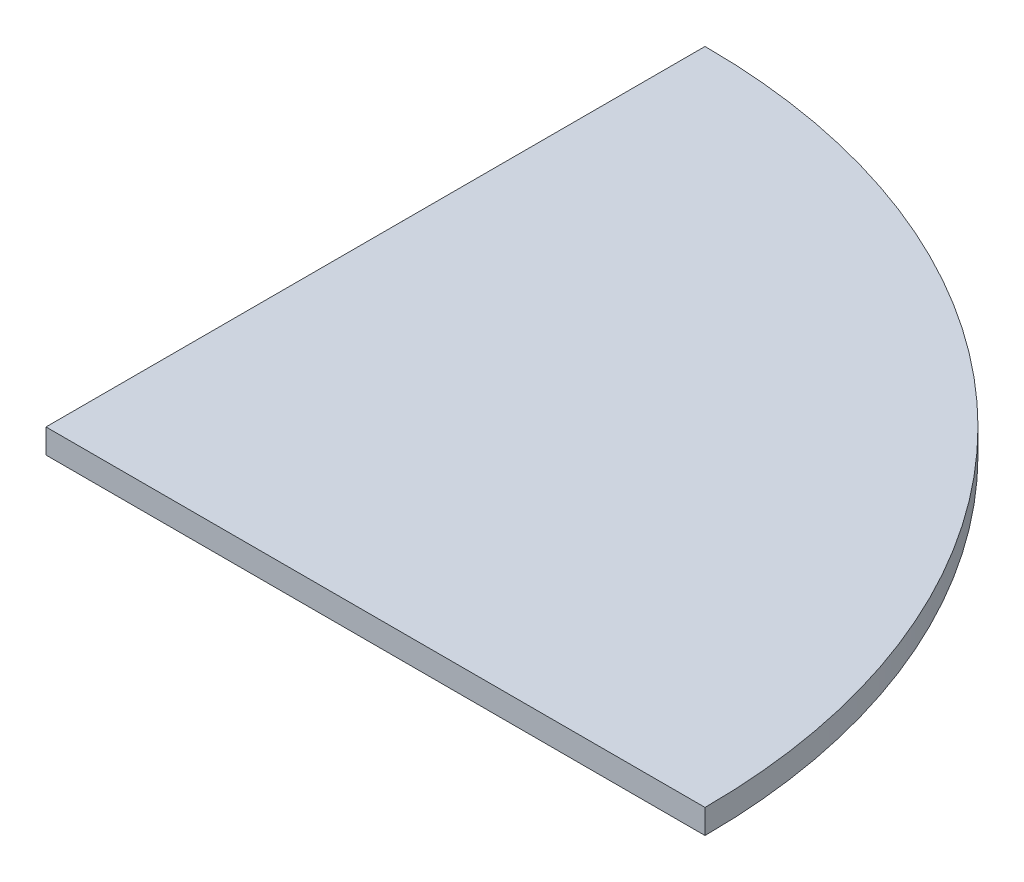
ISO-10303-21;
HEADER;
FILE_DESCRIPTION(('STEP AP214'),'2;1');
FILE_NAME('part.step','',(''),(''),'','','');
FILE_SCHEMA(('AUTOMOTIVE_DESIGN { 1 0 10303 214 1 1 1 1 }'));
ENDSEC;
DATA;
#1=APPLICATION_CONTEXT('core data for automotive mechanical design processes');
#2=APPLICATION_PROTOCOL_DEFINITION('international standard','automotive_design',2000,#1);
#3=PRODUCT_CONTEXT('',#1,'mechanical');
#4=PRODUCT('Part','Part','',(#3));
#5=PRODUCT_RELATED_PRODUCT_CATEGORY('part','',(#4));
#6=PRODUCT_DEFINITION_FORMATION('','',#4);
#7=PRODUCT_DEFINITION_CONTEXT('part definition',#1,'design');
#8=PRODUCT_DEFINITION('design','',#6,#7);
#9=PRODUCT_DEFINITION_SHAPE('','',#8);
#10=(LENGTH_UNIT() NAMED_UNIT(*) SI_UNIT(.MILLI.,.METRE.));
#11=(NAMED_UNIT(*) PLANE_ANGLE_UNIT() SI_UNIT($,.RADIAN.));
#12=(NAMED_UNIT(*) SI_UNIT($,.STERADIAN.) SOLID_ANGLE_UNIT());
#13=UNCERTAINTY_MEASURE_WITH_UNIT(LENGTH_MEASURE(1.E-05),#10,'distance_accuracy_value','');
#14=(GEOMETRIC_REPRESENTATION_CONTEXT(3) GLOBAL_UNCERTAINTY_ASSIGNED_CONTEXT((#13)) GLOBAL_UNIT_ASSIGNED_CONTEXT((#10,
#11,#12)) REPRESENTATION_CONTEXT('',''));
#15=CARTESIAN_POINT('',(0.,0.,0.));
#16=DIRECTION('',(0.,0.,1.));
#17=DIRECTION('',(1.,0.,0.));
#18=AXIS2_PLACEMENT_3D('',#15,#16,#17);
#19=CARTESIAN_POINT('',(0.,11.43,0.));
#20=DIRECTION('',(0.,0.,-1.));
#21=DIRECTION('',(-1.,0.,0.));
#22=AXIS2_PLACEMENT_3D('',#19,#20,#21);
#23=PLANE('',#22);
#24=DIRECTION('',(1.,0.,0.));
#25=VECTOR('',#24,1.);
#26=CARTESIAN_POINT('',(0.,-11.43,0.));
#27=LINE('',#26,#25);
#28=CARTESIAN_POINT('',(0.,-11.43,0.));
#29=VERTEX_POINT('',#28);
#30=CARTESIAN_POINT('',(618.236,-11.43,0.));
#31=VERTEX_POINT('',#30);
#32=EDGE_CURVE('E93',#29,#31,#27,.T.);
#33=ORIENTED_EDGE('',*,*,#32,.T.);
#34=DIRECTION('',(0.,-1.,0.));
#35=VECTOR('',#34,1.);
#36=CARTESIAN_POINT('',(618.236,11.43,0.));
#37=LINE('',#36,#35);
#38=CARTESIAN_POINT('',(618.236,11.43,0.));
#39=VERTEX_POINT('',#38);
#40=EDGE_CURVE('E11',#39,#31,#37,.T.);
#41=ORIENTED_EDGE('',*,*,#40,.F.);
#42=DIRECTION('',(1.,0.,0.));
#43=VECTOR('',#42,1.);
#44=CARTESIAN_POINT('',(0.,11.43,0.));
#45=LINE('',#44,#43);
#46=CARTESIAN_POINT('',(0.,11.43,0.));
#47=VERTEX_POINT('',#46);
#48=EDGE_CURVE('E85',#47,#39,#45,.T.);
#49=ORIENTED_EDGE('',*,*,#48,.F.);
#50=DIRECTION('',(0.,-1.,0.));
#51=VECTOR('',#50,1.);
#52=CARTESIAN_POINT('',(0.,11.43,0.));
#53=LINE('',#52,#51);
#54=EDGE_CURVE('E94',#47,#29,#53,.T.);
#55=ORIENTED_EDGE('',*,*,#54,.T.);
#56=EDGE_LOOP('',(#33,#41,#49,#55));
#57=FACE_BOUND('',#56,.T.);
#58=ADVANCED_FACE('F43',(#57),#23,.F.);
#59=CARTESIAN_POINT('',(0.,11.43,0.));
#60=DIRECTION('',(0.,-1.,0.));
#61=DIRECTION('',(0.,0.,-1.));
#62=AXIS2_PLACEMENT_3D('',#59,#60,#61);
#63=CYLINDRICAL_SURFACE('',#62,618.236);
#64=CARTESIAN_POINT('',(0.,-11.43,0.));
#65=DIRECTION('',(0.,1.,0.));
#66=DIRECTION('',(0.,0.,1.));
#67=AXIS2_PLACEMENT_3D('',#64,#65,#66);
#68=CIRCLE('',#67,618.236);
#69=CARTESIAN_POINT('',(0.,-11.43,-618.236));
#70=VERTEX_POINT('',#69);
#71=EDGE_CURVE('E72',#31,#70,#68,.T.);
#72=ORIENTED_EDGE('',*,*,#71,.T.);
#73=DIRECTION('',(0.,-1.,0.));
#74=VECTOR('',#73,1.);
#75=CARTESIAN_POINT('',(0.,11.43,-618.236));
#76=LINE('',#75,#74);
#77=CARTESIAN_POINT('',(0.,11.43,-618.236));
#78=VERTEX_POINT('',#77);
#79=EDGE_CURVE('E52',#78,#70,#76,.T.);
#80=ORIENTED_EDGE('',*,*,#79,.F.);
#81=CARTESIAN_POINT('',(0.,11.43,0.));
#82=DIRECTION('',(0.,1.,0.));
#83=DIRECTION('',(0.,0.,1.));
#84=AXIS2_PLACEMENT_3D('',#81,#82,#83);
#85=CIRCLE('',#84,618.236);
#86=EDGE_CURVE('E80',#39,#78,#85,.T.);
#87=ORIENTED_EDGE('',*,*,#86,.F.);
#88=ORIENTED_EDGE('',*,*,#40,.T.);
#89=EDGE_LOOP('',(#72,#80,#87,#88));
#90=FACE_BOUND('',#89,.T.);
#91=ADVANCED_FACE('F81',(#90),#63,.T.);
#92=CARTESIAN_POINT('',(0.,11.43,-618.236));
#93=DIRECTION('',(1.,0.,0.));
#94=DIRECTION('',(0.,0.,-1.));
#95=AXIS2_PLACEMENT_3D('',#92,#93,#94);
#96=PLANE('',#95);
#97=DIRECTION('',(0.,0.,1.));
#98=VECTOR('',#97,1.);
#99=CARTESIAN_POINT('',(0.,-11.43,-618.236));
#100=LINE('',#99,#98);
#101=EDGE_CURVE('E77',#70,#29,#100,.T.);
#102=ORIENTED_EDGE('',*,*,#101,.T.);
#103=ORIENTED_EDGE('',*,*,#54,.F.);
#104=DIRECTION('',(0.,0.,1.));
#105=VECTOR('',#104,1.);
#106=CARTESIAN_POINT('',(0.,11.43,-618.236));
#107=LINE('',#106,#105);
#108=EDGE_CURVE('E60',#78,#47,#107,.T.);
#109=ORIENTED_EDGE('',*,*,#108,.F.);
#110=ORIENTED_EDGE('',*,*,#79,.T.);
#111=EDGE_LOOP('',(#102,#103,#109,#110));
#112=FACE_BOUND('',#111,.T.);
#113=ADVANCED_FACE('F106',(#112),#96,.F.);
#114=CARTESIAN_POINT('',(0.,11.43,0.));
#115=DIRECTION('',(0.,1.,0.));
#116=DIRECTION('',(0.,0.,1.));
#117=AXIS2_PLACEMENT_3D('',#114,#115,#116);
#118=PLANE('',#117);
#119=ORIENTED_EDGE('',*,*,#48,.T.);
#120=ORIENTED_EDGE('',*,*,#86,.T.);
#121=ORIENTED_EDGE('',*,*,#108,.T.);
#122=EDGE_LOOP('',(#119,#120,#121));
#123=FACE_BOUND('',#122,.T.);
#124=ADVANCED_FACE('F88',(#123),#118,.T.);
#125=CARTESIAN_POINT('',(0.,-11.43,0.));
#126=DIRECTION('',(0.,1.,0.));
#127=DIRECTION('',(0.,0.,1.));
#128=AXIS2_PLACEMENT_3D('',#125,#126,#127);
#129=PLANE('',#128);
#130=ORIENTED_EDGE('',*,*,#32,.F.);
#131=ORIENTED_EDGE('',*,*,#101,.F.);
#132=ORIENTED_EDGE('',*,*,#71,.F.);
#133=EDGE_LOOP('',(#130,#131,#132));
#134=FACE_BOUND('',#133,.T.);
#135=ADVANCED_FACE('F107',(#134),#129,.F.);
#136=CLOSED_SHELL('',(#58,#91,#113,#124,#135));
#137=MANIFOLD_SOLID_BREP('B2',#136);
#138=ADVANCED_BREP_SHAPE_REPRESENTATION('',(#18,#137),#14);
#139=SHAPE_DEFINITION_REPRESENTATION(#9,#138);
ENDSEC;
END-ISO-10303-21;
